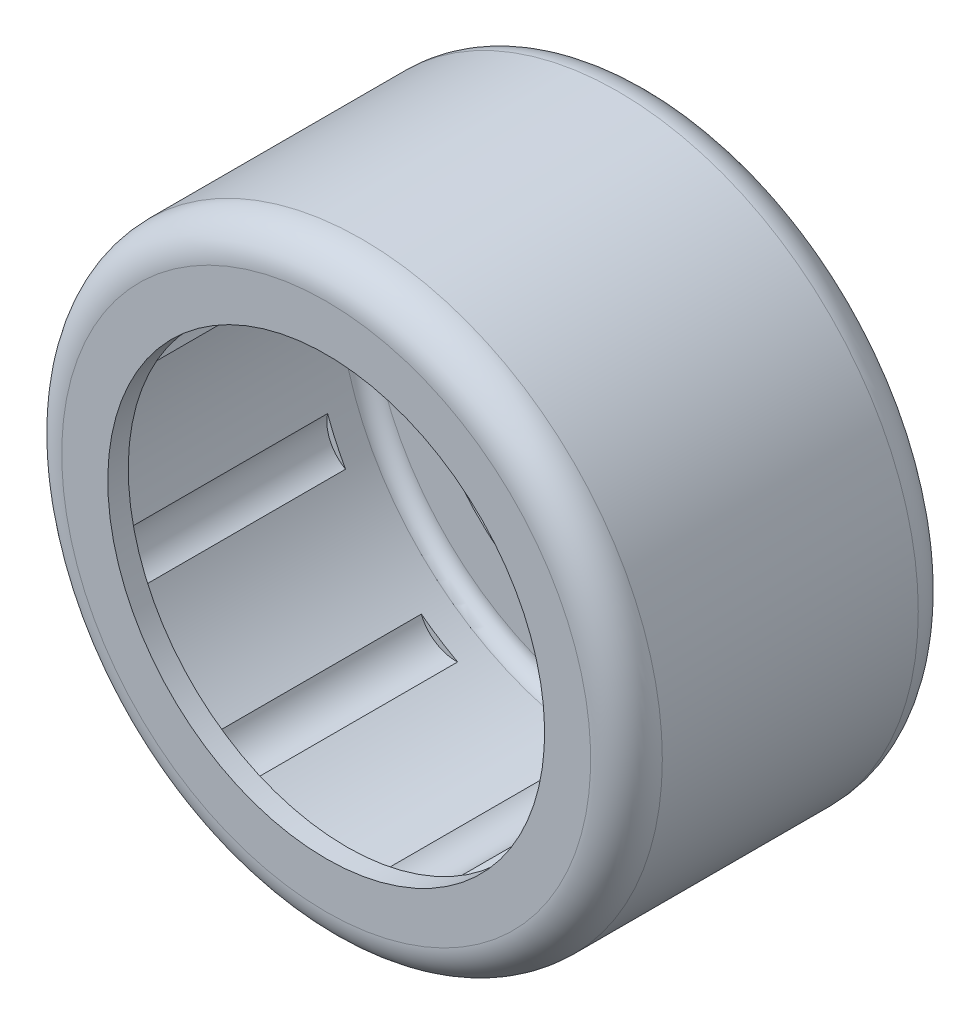
ISO-10303-21;
HEADER;
FILE_DESCRIPTION(('STEP AP214'),'2;1');
FILE_NAME('part.step','',(''),(''),'','','');
FILE_SCHEMA(('AUTOMOTIVE_DESIGN { 1 0 10303 214 1 1 1 1 }'));
ENDSEC;
DATA;
#1=APPLICATION_CONTEXT('core data for automotive mechanical design processes');
#2=APPLICATION_PROTOCOL_DEFINITION('international standard','automotive_design',2000,#1);
#3=PRODUCT_CONTEXT('',#1,'mechanical');
#4=PRODUCT('Part','Part','',(#3));
#5=PRODUCT_RELATED_PRODUCT_CATEGORY('part','',(#4));
#6=PRODUCT_DEFINITION_FORMATION('','',#4);
#7=PRODUCT_DEFINITION_CONTEXT('part definition',#1,'design');
#8=PRODUCT_DEFINITION('design','',#6,#7);
#9=PRODUCT_DEFINITION_SHAPE('','',#8);
#10=(LENGTH_UNIT() NAMED_UNIT(*) SI_UNIT(.MILLI.,.METRE.));
#11=(NAMED_UNIT(*) PLANE_ANGLE_UNIT() SI_UNIT($,.RADIAN.));
#12=(NAMED_UNIT(*) SI_UNIT($,.STERADIAN.) SOLID_ANGLE_UNIT());
#13=UNCERTAINTY_MEASURE_WITH_UNIT(LENGTH_MEASURE(1.E-05),#10,'distance_accuracy_value','');
#14=(GEOMETRIC_REPRESENTATION_CONTEXT(3) GLOBAL_UNCERTAINTY_ASSIGNED_CONTEXT((#13)) GLOBAL_UNIT_ASSIGNED_CONTEXT((#10,
#11,#12)) REPRESENTATION_CONTEXT('',''));
#15=CARTESIAN_POINT('',(0.,0.,0.));
#16=DIRECTION('',(0.,0.,1.));
#17=DIRECTION('',(1.,0.,0.));
#18=AXIS2_PLACEMENT_3D('',#15,#16,#17);
#19=CARTESIAN_POINT('',(0.,0.,11.625));
#20=DIRECTION('',(0.,0.,-1.));
#21=DIRECTION('',(0.,-1.,0.));
#22=AXIS2_PLACEMENT_3D('',#19,#20,#21);
#23=CYLINDRICAL_SURFACE('',#22,8.);
#24=CARTESIAN_POINT('',(0.,0.,0.750000000000015));
#25=DIRECTION('',(0.,0.,-1.));
#26=DIRECTION('',(-1.,0.,0.));
#27=AXIS2_PLACEMENT_3D('',#24,#25,#26);
#28=CIRCLE('',#27,8.);
#29=CARTESIAN_POINT('',(-8.,0.,0.750000000000015));
#30=VERTEX_POINT('',#29);
#31=EDGE_CURVE('E349',#30,#30,#28,.T.);
#32=ORIENTED_EDGE('',*,*,#31,.F.);
#33=EDGE_LOOP('',(#32));
#34=FACE_BOUND('',#33,.T.);
#35=CARTESIAN_POINT('',(0.,0.,0.));
#36=DIRECTION('',(0.,0.,-1.));
#37=DIRECTION('',(1.,0.,0.));
#38=AXIS2_PLACEMENT_3D('',#35,#36,#37);
#39=CIRCLE('',#38,8.);
#40=CARTESIAN_POINT('',(8.,0.,0.));
#41=VERTEX_POINT('',#40);
#42=EDGE_CURVE('E367',#41,#41,#39,.T.);
#43=ORIENTED_EDGE('',*,*,#42,.T.);
#44=EDGE_LOOP('',(#43));
#45=FACE_BOUND('',#44,.T.);
#46=ADVANCED_FACE('F17',(#34,#45),#23,.F.);
#47=CARTESIAN_POINT('',(0.,0.,11.625));
#48=DIRECTION('',(0.,0.,-1.));
#49=DIRECTION('',(0.,-1.,0.));
#50=AXIS2_PLACEMENT_3D('',#47,#48,#49);
#51=CYLINDRICAL_SURFACE('',#50,8.);
#52=CARTESIAN_POINT('',(0.,0.,12.));
#53=DIRECTION('',(0.,0.,-1.));
#54=DIRECTION('',(0.,-1.,0.));
#55=AXIS2_PLACEMENT_3D('',#52,#53,#54);
#56=CIRCLE('',#55,8.);
#57=CARTESIAN_POINT('',(0.,-8.,12.));
#58=VERTEX_POINT('',#57);
#59=EDGE_CURVE('E340',#58,#58,#56,.T.);
#60=ORIENTED_EDGE('',*,*,#59,.F.);
#61=EDGE_LOOP('',(#60));
#62=FACE_BOUND('',#61,.T.);
#63=CARTESIAN_POINT('',(0.,0.,11.25));
#64=DIRECTION('',(0.,0.,-1.));
#65=DIRECTION('',(0.,-1.,0.));
#66=AXIS2_PLACEMENT_3D('',#63,#64,#65);
#67=CIRCLE('',#66,8.);
#68=CARTESIAN_POINT('',(0.,-8.,11.25));
#69=VERTEX_POINT('',#68);
#70=EDGE_CURVE('E11',#69,#69,#67,.T.);
#71=ORIENTED_EDGE('',*,*,#70,.T.);
#72=EDGE_LOOP('',(#71));
#73=FACE_BOUND('',#72,.T.);
#74=ADVANCED_FACE('F563',(#62,#73),#51,.F.);
#75=CARTESIAN_POINT('',(0.,-9.125,11.25));
#76=DIRECTION('',(0.,0.,-1.));
#77=DIRECTION('',(0.,-1.,0.));
#78=AXIS2_PLACEMENT_3D('',#75,#76,#77);
#79=PLANE('',#78);
#80=ORIENTED_EDGE('',*,*,#70,.F.);
#81=EDGE_LOOP('',(#80));
#82=FACE_BOUND('',#81,.T.);
#83=CARTESIAN_POINT('',(0.,0.,11.25));
#84=DIRECTION('',(0.,0.,1.));
#85=DIRECTION('',(0.,1.,0.));
#86=AXIS2_PLACEMENT_3D('',#83,#84,#85);
#87=CIRCLE('',#86,9.6875);
#88=CARTESIAN_POINT('',(0.,9.6875,11.25));
#89=VERTEX_POINT('',#88);
#90=EDGE_CURVE('E27',#89,#89,#87,.T.);
#91=ORIENTED_EDGE('',*,*,#90,.F.);
#92=EDGE_LOOP('',(#91));
#93=FACE_BOUND('',#92,.T.);
#94=ADVANCED_FACE('F568',(#82,#93),#79,.T.);
#95=CARTESIAN_POINT('',(0.,0.,10.6875));
#96=DIRECTION('',(0.,0.,-1.));
#97=DIRECTION('',(1.,0.,0.));
#98=AXIS2_PLACEMENT_3D('',#95,#96,#97);
#99=TOROIDAL_SURFACE('',#98,9.6875,0.5625);
#100=ORIENTED_EDGE('',*,*,#90,.T.);
#101=EDGE_LOOP('',(#100));
#102=FACE_BOUND('',#101,.T.);
#103=CARTESIAN_POINT('',(0.,0.,10.6875));
#104=DIRECTION('',(0.,0.,-1.));
#105=DIRECTION('',(0.,1.,0.));
#106=AXIS2_PLACEMENT_3D('',#103,#104,#105);
#107=CIRCLE('',#106,10.25);
#108=CARTESIAN_POINT('',(0.,10.25,10.6875));
#109=VERTEX_POINT('',#108);
#110=EDGE_CURVE('E359',#109,#109,#107,.T.);
#111=ORIENTED_EDGE('',*,*,#110,.T.);
#112=EDGE_LOOP('',(#111));
#113=FACE_BOUND('',#112,.T.);
#114=ADVANCED_FACE('F612',(#102,#113),#99,.F.);
#115=CARTESIAN_POINT('',(0.,-9.125,0.750000000000015));
#116=DIRECTION('',(0.,0.,1.));
#117=DIRECTION('',(1.,0.,0.));
#118=AXIS2_PLACEMENT_3D('',#115,#116,#117);
#119=PLANE('',#118);
#120=ORIENTED_EDGE('',*,*,#31,.T.);
#121=EDGE_LOOP('',(#120));
#122=FACE_BOUND('',#121,.T.);
#123=CARTESIAN_POINT('',(0.,0.,0.750000000000015));
#124=DIRECTION('',(0.,0.,-1.));
#125=DIRECTION('',(0.,1.,0.));
#126=AXIS2_PLACEMENT_3D('',#123,#124,#125);
#127=CIRCLE('',#126,9.6875);
#128=CARTESIAN_POINT('',(0.,9.6875,0.750000000000015));
#129=VERTEX_POINT('',#128);
#130=EDGE_CURVE('E336',#129,#129,#127,.T.);
#131=ORIENTED_EDGE('',*,*,#130,.F.);
#132=EDGE_LOOP('',(#131));
#133=FACE_BOUND('',#132,.T.);
#134=ADVANCED_FACE('F664',(#122,#133),#119,.T.);
#135=CARTESIAN_POINT('',(0.,0.,10.1136351921262));
#136=DIRECTION('',(0.,0.,-1.));
#137=DIRECTION('',(0.,-1.,0.));
#138=AXIS2_PLACEMENT_3D('',#135,#136,#137);
#139=CYLINDRICAL_SURFACE('',#138,10.25);
#140=ORIENTED_EDGE('',*,*,#110,.F.);
#141=EDGE_LOOP('',(#140));
#142=FACE_BOUND('',#141,.T.);
#143=CARTESIAN_POINT('',(0.,0.,2.325));
#144=DIRECTION('',(0.,0.,1.));
#145=DIRECTION('',(0.,-1.,0.));
#146=AXIS2_PLACEMENT_3D('',#143,#144,#145);
#147=CIRCLE('',#146,10.25);
#148=CARTESIAN_POINT('',(-0.790316225389345,-10.2194863013699,2.325));
#149=VERTEX_POINT('',#148);
#150=CARTESIAN_POINT('',(0.790316225389429,-10.2194863013699,2.325));
#151=VERTEX_POINT('',#150);
#152=EDGE_CURVE('E253',#149,#151,#147,.T.);
#153=ORIENTED_EDGE('',*,*,#152,.T.);
#154=DIRECTION('',(0.,0.,1.));
#155=VECTOR('',#154,1.);
#156=CARTESIAN_POINT('',(0.790316225389429,-10.2194863013699,6.));
#157=LINE('',#156,#155);
#158=CARTESIAN_POINT('',(0.790316225389429,-10.2194863013699,9.675));
#159=VERTEX_POINT('',#158);
#160=EDGE_CURVE('E237',#151,#159,#157,.T.);
#161=ORIENTED_EDGE('',*,*,#160,.T.);
#162=CARTESIAN_POINT('',(0.,0.,9.675));
#163=DIRECTION('',(0.,0.,-1.));
#164=DIRECTION('',(0.,1.,0.));
#165=AXIS2_PLACEMENT_3D('',#162,#163,#164);
#166=CIRCLE('',#165,10.25);
#167=CARTESIAN_POINT('',(-0.790316225389345,-10.2194863013699,9.675));
#168=VERTEX_POINT('',#167);
#169=EDGE_CURVE('E264',#159,#168,#166,.T.);
#170=ORIENTED_EDGE('',*,*,#169,.T.);
#171=DIRECTION('',(0.,0.,-1.));
#172=VECTOR('',#171,1.);
#173=CARTESIAN_POINT('',(-0.790316225389345,-10.2194863013699,6.));
#174=LINE('',#173,#172);
#175=EDGE_CURVE('E249',#168,#149,#174,.T.);
#176=ORIENTED_EDGE('',*,*,#175,.T.);
#177=EDGE_LOOP('',(#153,#161,#170,#176));
#178=FACE_BOUND('',#177,.T.);
#179=CARTESIAN_POINT('',(0.,0.,2.325));
#180=DIRECTION('',(0.,0.,1.));
#181=DIRECTION('',(0.,-1.,0.));
#182=AXIS2_PLACEMENT_3D('',#179,#180,#181);
#183=CIRCLE('',#182,10.25);
#184=CARTESIAN_POINT('',(-6.18992774461147,-8.1699017446043,2.325));
#185=VERTEX_POINT('',#184);
#186=CARTESIAN_POINT('',(-4.86021511128622,-9.02445616489023,2.325));
#187=VERTEX_POINT('',#186);
#188=EDGE_CURVE('E417',#185,#187,#183,.T.);
#189=ORIENTED_EDGE('',*,*,#188,.T.);
#190=DIRECTION('',(0.,0.,1.));
#191=VECTOR('',#190,1.);
#192=CARTESIAN_POINT('',(-4.86021511128622,-9.02445616489023,6.));
#193=LINE('',#192,#191);
#194=CARTESIAN_POINT('',(-4.86021511128622,-9.02445616489023,9.675));
#195=VERTEX_POINT('',#194);
#196=EDGE_CURVE('E416',#187,#195,#193,.T.);
#197=ORIENTED_EDGE('',*,*,#196,.T.);
#198=CARTESIAN_POINT('',(0.,0.,9.675));
#199=DIRECTION('',(0.,0.,-1.));
#200=DIRECTION('',(0.,1.,0.));
#201=AXIS2_PLACEMENT_3D('',#198,#199,#200);
#202=CIRCLE('',#201,10.25);
#203=CARTESIAN_POINT('',(-6.18992774461147,-8.1699017446043,9.675));
#204=VERTEX_POINT('',#203);
#205=EDGE_CURVE('E442',#195,#204,#202,.T.);
#206=ORIENTED_EDGE('',*,*,#205,.T.);
#207=DIRECTION('',(0.,0.,-1.));
#208=VECTOR('',#207,1.);
#209=CARTESIAN_POINT('',(-6.18992774461147,-8.1699017446043,6.));
#210=LINE('',#209,#208);
#211=EDGE_CURVE('E426',#204,#185,#210,.T.);
#212=ORIENTED_EDGE('',*,*,#211,.T.);
#213=EDGE_LOOP('',(#189,#197,#206,#212));
#214=FACE_BOUND('',#213,.T.);
#215=CARTESIAN_POINT('',(0.,0.,2.325));
#216=DIRECTION('',(0.,0.,1.));
#217=DIRECTION('',(0.,-1.,0.));
#218=AXIS2_PLACEMENT_3D('',#215,#216,#217);
#219=CIRCLE('',#218,10.25);
#220=CARTESIAN_POINT('',(-9.62428094085893,-3.5264311096942,2.325));
#221=VERTEX_POINT('',#220);
#222=CARTESIAN_POINT('',(-8.96766249076746,-4.96422495981819,2.325));
#223=VERTEX_POINT('',#222);
#224=EDGE_CURVE('E329',#221,#223,#219,.T.);
#225=ORIENTED_EDGE('',*,*,#224,.T.);
#226=DIRECTION('',(0.,0.,1.));
#227=VECTOR('',#226,1.);
#228=CARTESIAN_POINT('',(-8.96766249076746,-4.96422495981819,6.));
#229=LINE('',#228,#227);
#230=CARTESIAN_POINT('',(-8.96766249076746,-4.96422495981819,9.675));
#231=VERTEX_POINT('',#230);
#232=EDGE_CURVE('E313',#223,#231,#229,.T.);
#233=ORIENTED_EDGE('',*,*,#232,.T.);
#234=CARTESIAN_POINT('',(0.,0.,9.675));
#235=DIRECTION('',(0.,0.,-1.));
#236=DIRECTION('',(0.,1.,0.));
#237=AXIS2_PLACEMENT_3D('',#234,#235,#236);
#238=CIRCLE('',#237,10.25);
#239=CARTESIAN_POINT('',(-9.62428094085893,-3.5264311096942,9.675));
#240=VERTEX_POINT('',#239);
#241=EDGE_CURVE('E375',#231,#240,#238,.T.);
#242=ORIENTED_EDGE('',*,*,#241,.T.);
#243=DIRECTION('',(0.,0.,-1.));
#244=VECTOR('',#243,1.);
#245=CARTESIAN_POINT('',(-9.62428094085893,-3.5264311096942,6.));
#246=LINE('',#245,#244);
#247=EDGE_CURVE('E316',#240,#221,#246,.T.);
#248=ORIENTED_EDGE('',*,*,#247,.T.);
#249=EDGE_LOOP('',(#225,#233,#242,#248));
#250=FACE_BOUND('',#249,.T.);
#251=CARTESIAN_POINT('',(0.,0.,2.325));
#252=DIRECTION('',(0.,0.,1.));
#253=DIRECTION('',(0.,-1.,0.));
#254=AXIS2_PLACEMENT_3D('',#251,#252,#253);
#255=CIRCLE('',#254,10.25);
#256=CARTESIAN_POINT('',(-10.0029929403033,2.23665648597226,2.325));
#257=VERTEX_POINT('',#256);
#258=CARTESIAN_POINT('',(-10.2279403919054,0.672112594458652,2.325));
#259=VERTEX_POINT('',#258);
#260=EDGE_CURVE('E297',#257,#259,#255,.T.);
#261=ORIENTED_EDGE('',*,*,#260,.T.);
#262=DIRECTION('',(0.,0.,1.));
#263=VECTOR('',#262,1.);
#264=CARTESIAN_POINT('',(-10.2279403919054,0.672112594458652,6.));
#265=LINE('',#264,#263);
#266=CARTESIAN_POINT('',(-10.2279403919054,0.672112594458652,9.675));
#267=VERTEX_POINT('',#266);
#268=EDGE_CURVE('E303',#259,#267,#265,.T.);
#269=ORIENTED_EDGE('',*,*,#268,.T.);
#270=CARTESIAN_POINT('',(0.,0.,9.675));
#271=DIRECTION('',(0.,0.,-1.));
#272=DIRECTION('',(0.,1.,0.));
#273=AXIS2_PLACEMENT_3D('',#270,#271,#272);
#274=CIRCLE('',#273,10.25);
#275=CARTESIAN_POINT('',(-10.0029929403033,2.23665648597226,9.675));
#276=VERTEX_POINT('',#275);
#277=EDGE_CURVE('E479',#267,#276,#274,.T.);
#278=ORIENTED_EDGE('',*,*,#277,.T.);
#279=DIRECTION('',(0.,0.,-1.));
#280=VECTOR('',#279,1.);
#281=CARTESIAN_POINT('',(-10.0029929403033,2.23665648597226,6.));
#282=LINE('',#281,#280);
#283=EDGE_CURVE('E305',#276,#257,#282,.T.);
#284=ORIENTED_EDGE('',*,*,#283,.T.);
#285=EDGE_LOOP('',(#261,#269,#278,#284));
#286=FACE_BOUND('',#285,.T.);
#287=CARTESIAN_POINT('',(0.,0.,2.325));
#288=DIRECTION('',(0.,0.,1.));
#289=DIRECTION('',(0.,-1.,0.));
#290=AXIS2_PLACEMENT_3D('',#287,#288,#289);
#291=CIRCLE('',#290,10.25);
#292=CARTESIAN_POINT('',(-7.20582535897205,7.28962145080214,2.325));
#293=VERTEX_POINT('',#292);
#294=CARTESIAN_POINT('',(-8.24091948578677,6.09505914891562,2.325));
#295=VERTEX_POINT('',#294);
#296=EDGE_CURVE('E341',#293,#295,#291,.T.);
#297=ORIENTED_EDGE('',*,*,#296,.T.);
#298=DIRECTION('',(0.,0.,1.));
#299=VECTOR('',#298,1.);
#300=CARTESIAN_POINT('',(-8.24091948578677,6.09505914891562,6.));
#301=LINE('',#300,#299);
#302=CARTESIAN_POINT('',(-8.24091948578677,6.09505914891562,9.675));
#303=VERTEX_POINT('',#302);
#304=EDGE_CURVE('E468',#295,#303,#301,.T.);
#305=ORIENTED_EDGE('',*,*,#304,.T.);
#306=CARTESIAN_POINT('',(0.,0.,9.675));
#307=DIRECTION('',(0.,0.,-1.));
#308=DIRECTION('',(0.,1.,0.));
#309=AXIS2_PLACEMENT_3D('',#306,#307,#308);
#310=CIRCLE('',#309,10.25);
#311=CARTESIAN_POINT('',(-7.20582535897205,7.28962145080214,9.675));
#312=VERTEX_POINT('',#311);
#313=EDGE_CURVE('E461',#303,#312,#310,.T.);
#314=ORIENTED_EDGE('',*,*,#313,.T.);
#315=DIRECTION('',(0.,0.,-1.));
#316=VECTOR('',#315,1.);
#317=CARTESIAN_POINT('',(-7.20582535897205,7.28962145080214,6.));
#318=LINE('',#317,#316);
#319=EDGE_CURVE('E476',#312,#293,#318,.T.);
#320=ORIENTED_EDGE('',*,*,#319,.T.);
#321=EDGE_LOOP('',(#297,#305,#314,#320));
#322=FACE_BOUND('',#321,.T.);
#323=CARTESIAN_POINT('',(0.,0.,2.325));
#324=DIRECTION('',(0.,0.,1.));
#325=DIRECTION('',(0.,-1.,0.));
#326=AXIS2_PLACEMENT_3D('',#323,#324,#325);
#327=CIRCLE('',#326,10.25);
#328=CARTESIAN_POINT('',(-2.12085914009622,10.0281831110062,2.325));
#329=VERTEX_POINT('',#328);
#330=CARTESIAN_POINT('',(-3.63746487048551,9.58286748922177,2.325));
#331=VERTEX_POINT('',#330);
#332=EDGE_CURVE('E453',#329,#331,#327,.T.);
#333=ORIENTED_EDGE('',*,*,#332,.T.);
#334=DIRECTION('',(0.,0.,1.));
#335=VECTOR('',#334,1.);
#336=CARTESIAN_POINT('',(-3.63746487048549,9.58286748922177,6.));
#337=LINE('',#336,#335);
#338=CARTESIAN_POINT('',(-3.63746487048551,9.58286748922177,9.675));
#339=VERTEX_POINT('',#338);
#340=EDGE_CURVE('E350',#331,#339,#337,.T.);
#341=ORIENTED_EDGE('',*,*,#340,.T.);
#342=CARTESIAN_POINT('',(0.,0.,9.675));
#343=DIRECTION('',(0.,0.,-1.));
#344=DIRECTION('',(0.,1.,0.));
#345=AXIS2_PLACEMENT_3D('',#342,#343,#344);
#346=CIRCLE('',#345,10.25);
#347=CARTESIAN_POINT('',(-2.12085914009622,10.0281831110062,9.675));
#348=VERTEX_POINT('',#347);
#349=EDGE_CURVE('E320',#339,#348,#346,.T.);
#350=ORIENTED_EDGE('',*,*,#349,.T.);
#351=DIRECTION('',(0.,0.,-1.));
#352=VECTOR('',#351,1.);
#353=CARTESIAN_POINT('',(-2.12085914009622,10.0281831110062,6.));
#354=LINE('',#353,#352);
#355=EDGE_CURVE('E353',#348,#329,#354,.T.);
#356=ORIENTED_EDGE('',*,*,#355,.T.);
#357=EDGE_LOOP('',(#333,#341,#350,#356));
#358=FACE_BOUND('',#357,.T.);
#359=CARTESIAN_POINT('',(0.,0.,2.325));
#360=DIRECTION('',(0.,0.,1.));
#361=DIRECTION('',(0.,-1.,0.));
#362=AXIS2_PLACEMENT_3D('',#359,#360,#361);
#363=CIRCLE('',#362,10.25);
#364=CARTESIAN_POINT('',(3.63746487048558,9.58286748922177,2.325));
#365=VERTEX_POINT('',#364);
#366=CARTESIAN_POINT('',(2.1208591400963,10.0281831110062,2.325));
#367=VERTEX_POINT('',#366);
#368=EDGE_CURVE('E287',#365,#367,#363,.T.);
#369=ORIENTED_EDGE('',*,*,#368,.T.);
#370=DIRECTION('',(0.,0.,1.));
#371=VECTOR('',#370,1.);
#372=CARTESIAN_POINT('',(2.1208591400963,10.0281831110062,6.));
#373=LINE('',#372,#371);
#374=CARTESIAN_POINT('',(2.1208591400963,10.0281831110062,9.675));
#375=VERTEX_POINT('',#374);
#376=EDGE_CURVE('E321',#367,#375,#373,.T.);
#377=ORIENTED_EDGE('',*,*,#376,.T.);
#378=CARTESIAN_POINT('',(0.,0.,9.675));
#379=DIRECTION('',(0.,0.,-1.));
#380=DIRECTION('',(0.,1.,0.));
#381=AXIS2_PLACEMENT_3D('',#378,#379,#380);
#382=CIRCLE('',#381,10.25);
#383=CARTESIAN_POINT('',(3.63746487048558,9.58286748922177,9.675));
#384=VERTEX_POINT('',#383);
#385=EDGE_CURVE('E402',#375,#384,#382,.T.);
#386=ORIENTED_EDGE('',*,*,#385,.T.);
#387=DIRECTION('',(0.,0.,-1.));
#388=VECTOR('',#387,1.);
#389=CARTESIAN_POINT('',(3.63746487048558,9.58286748922177,6.));
#390=LINE('',#389,#388);
#391=EDGE_CURVE('E317',#384,#365,#390,.T.);
#392=ORIENTED_EDGE('',*,*,#391,.T.);
#393=EDGE_LOOP('',(#369,#377,#386,#392));
#394=FACE_BOUND('',#393,.T.);
#395=CARTESIAN_POINT('',(0.,0.,2.325));
#396=DIRECTION('',(0.,0.,1.));
#397=DIRECTION('',(0.,-1.,0.));
#398=AXIS2_PLACEMENT_3D('',#395,#396,#397);
#399=CIRCLE('',#398,10.25);
#400=CARTESIAN_POINT('',(8.24091948578686,6.09505914891562,2.325));
#401=VERTEX_POINT('',#400);
#402=CARTESIAN_POINT('',(7.20582535897213,7.28962145080214,2.325));
#403=VERTEX_POINT('',#402);
#404=EDGE_CURVE('E273',#401,#403,#399,.T.);
#405=ORIENTED_EDGE('',*,*,#404,.T.);
#406=DIRECTION('',(0.,0.,1.));
#407=VECTOR('',#406,1.);
#408=CARTESIAN_POINT('',(7.20582535897213,7.28962145080214,6.));
#409=LINE('',#408,#407);
#410=CARTESIAN_POINT('',(7.20582535897213,7.28962145080214,9.675));
#411=VERTEX_POINT('',#410);
#412=EDGE_CURVE('E381',#403,#411,#409,.T.);
#413=ORIENTED_EDGE('',*,*,#412,.T.);
#414=CARTESIAN_POINT('',(0.,0.,9.675));
#415=DIRECTION('',(0.,0.,-1.));
#416=DIRECTION('',(0.,1.,0.));
#417=AXIS2_PLACEMENT_3D('',#414,#415,#416);
#418=CIRCLE('',#417,10.25);
#419=CARTESIAN_POINT('',(8.24091948578684,6.09505914891562,9.675));
#420=VERTEX_POINT('',#419);
#421=EDGE_CURVE('E274',#411,#420,#418,.T.);
#422=ORIENTED_EDGE('',*,*,#421,.T.);
#423=DIRECTION('',(0.,0.,-1.));
#424=VECTOR('',#423,1.);
#425=CARTESIAN_POINT('',(8.24091948578684,6.09505914891562,6.));
#426=LINE('',#425,#424);
#427=EDGE_CURVE('E391',#420,#401,#426,.T.);
#428=ORIENTED_EDGE('',*,*,#427,.T.);
#429=EDGE_LOOP('',(#405,#413,#422,#428));
#430=FACE_BOUND('',#429,.T.);
#431=CARTESIAN_POINT('',(0.,0.,2.325));
#432=DIRECTION('',(0.,0.,1.));
#433=DIRECTION('',(0.,-1.,0.));
#434=AXIS2_PLACEMENT_3D('',#431,#432,#433);
#435=CIRCLE('',#434,10.25);
#436=CARTESIAN_POINT('',(10.2279403919054,0.672112594458652,2.325));
#437=VERTEX_POINT('',#436);
#438=CARTESIAN_POINT('',(10.0029929403033,2.23665648597226,2.325));
#439=VERTEX_POINT('',#438);
#440=EDGE_CURVE('E418',#437,#439,#435,.T.);
#441=ORIENTED_EDGE('',*,*,#440,.T.);
#442=DIRECTION('',(0.,0.,1.));
#443=VECTOR('',#442,1.);
#444=CARTESIAN_POINT('',(10.0029929403033,2.23665648597226,6.));
#445=LINE('',#444,#443);
#446=CARTESIAN_POINT('',(10.0029929403033,2.23665648597226,9.675));
#447=VERTEX_POINT('',#446);
#448=EDGE_CURVE('E296',#439,#447,#445,.T.);
#449=ORIENTED_EDGE('',*,*,#448,.T.);
#450=CARTESIAN_POINT('',(0.,0.,9.675));
#451=DIRECTION('',(0.,0.,-1.));
#452=DIRECTION('',(0.,1.,0.));
#453=AXIS2_PLACEMENT_3D('',#450,#451,#452);
#454=CIRCLE('',#453,10.25);
#455=CARTESIAN_POINT('',(10.2279403919054,0.672112594458652,9.675));
#456=VERTEX_POINT('',#455);
#457=EDGE_CURVE('E446',#447,#456,#454,.T.);
#458=ORIENTED_EDGE('',*,*,#457,.T.);
#459=DIRECTION('',(0.,0.,-1.));
#460=VECTOR('',#459,1.);
#461=CARTESIAN_POINT('',(10.2279403919054,0.672112594458652,6.));
#462=LINE('',#461,#460);
#463=EDGE_CURVE('E293',#456,#437,#462,.T.);
#464=ORIENTED_EDGE('',*,*,#463,.T.);
#465=EDGE_LOOP('',(#441,#449,#458,#464));
#466=FACE_BOUND('',#465,.T.);
#467=CARTESIAN_POINT('',(0.,0.,2.325));
#468=DIRECTION('',(0.,0.,1.));
#469=DIRECTION('',(0.,-1.,0.));
#470=AXIS2_PLACEMENT_3D('',#467,#468,#469);
#471=CIRCLE('',#470,10.25);
#472=CARTESIAN_POINT('',(8.96766249076755,-4.96422495981819,2.325));
#473=VERTEX_POINT('',#472);
#474=CARTESIAN_POINT('',(9.62428094085901,-3.5264311096942,2.325));
#475=VERTEX_POINT('',#474);
#476=EDGE_CURVE('E363',#473,#475,#471,.T.);
#477=ORIENTED_EDGE('',*,*,#476,.T.);
#478=DIRECTION('',(0.,0.,1.));
#479=VECTOR('',#478,1.);
#480=CARTESIAN_POINT('',(9.62428094085901,-3.5264311096942,6.));
#481=LINE('',#480,#479);
#482=CARTESIAN_POINT('',(9.62428094085901,-3.5264311096942,9.675));
#483=VERTEX_POINT('',#482);
#484=EDGE_CURVE('E275',#475,#483,#481,.T.);
#485=ORIENTED_EDGE('',*,*,#484,.T.);
#486=CARTESIAN_POINT('',(0.,0.,9.675));
#487=DIRECTION('',(0.,0.,-1.));
#488=DIRECTION('',(0.,1.,0.));
#489=AXIS2_PLACEMENT_3D('',#486,#487,#488);
#490=CIRCLE('',#489,10.25);
#491=CARTESIAN_POINT('',(8.96766249076754,-4.96422495981819,9.675));
#492=VERTEX_POINT('',#491);
#493=EDGE_CURVE('E281',#483,#492,#490,.T.);
#494=ORIENTED_EDGE('',*,*,#493,.T.);
#495=DIRECTION('',(0.,0.,-1.));
#496=VECTOR('',#495,1.);
#497=CARTESIAN_POINT('',(8.96766249076755,-4.96422495981819,6.));
#498=LINE('',#497,#496);
#499=EDGE_CURVE('E279',#492,#473,#498,.T.);
#500=ORIENTED_EDGE('',*,*,#499,.T.);
#501=EDGE_LOOP('',(#477,#485,#494,#500));
#502=FACE_BOUND('',#501,.T.);
#503=CARTESIAN_POINT('',(0.,0.,2.325));
#504=DIRECTION('',(0.,0.,1.));
#505=DIRECTION('',(0.,-1.,0.));
#506=AXIS2_PLACEMENT_3D('',#503,#504,#505);
#507=CIRCLE('',#506,10.25);
#508=CARTESIAN_POINT('',(4.8602151112863,-9.02445616489023,2.325));
#509=VERTEX_POINT('',#508);
#510=CARTESIAN_POINT('',(6.18992774461155,-8.1699017446043,2.325));
#511=VERTEX_POINT('',#510);
#512=EDGE_CURVE('E311',#509,#511,#507,.T.);
#513=ORIENTED_EDGE('',*,*,#512,.T.);
#514=DIRECTION('',(0.,0.,1.));
#515=VECTOR('',#514,1.);
#516=CARTESIAN_POINT('',(6.18992774461155,-8.1699017446043,6.));
#517=LINE('',#516,#515);
#518=CARTESIAN_POINT('',(6.18992774461155,-8.1699017446043,9.675));
#519=VERTEX_POINT('',#518);
#520=EDGE_CURVE('E324',#511,#519,#517,.T.);
#521=ORIENTED_EDGE('',*,*,#520,.T.);
#522=CARTESIAN_POINT('',(0.,0.,9.675));
#523=DIRECTION('',(0.,0.,-1.));
#524=DIRECTION('',(0.,-1.,0.));
#525=AXIS2_PLACEMENT_3D('',#522,#523,#524);
#526=CIRCLE('',#525,10.25);
#527=CARTESIAN_POINT('',(4.8602151112863,-9.02445616489023,9.675));
#528=VERTEX_POINT('',#527);
#529=EDGE_CURVE('E312',#519,#528,#526,.T.);
#530=ORIENTED_EDGE('',*,*,#529,.T.);
#531=DIRECTION('',(0.,0.,-1.));
#532=VECTOR('',#531,1.);
#533=CARTESIAN_POINT('',(4.8602151112863,-9.02445616489023,6.));
#534=LINE('',#533,#532);
#535=EDGE_CURVE('E286',#528,#509,#534,.T.);
#536=ORIENTED_EDGE('',*,*,#535,.T.);
#537=EDGE_LOOP('',(#513,#521,#530,#536));
#538=FACE_BOUND('',#537,.T.);
#539=CARTESIAN_POINT('',(0.,0.,1.3125));
#540=DIRECTION('',(0.,0.,1.));
#541=DIRECTION('',(0.,1.,0.));
#542=AXIS2_PLACEMENT_3D('',#539,#540,#541);
#543=CIRCLE('',#542,10.25);
#544=CARTESIAN_POINT('',(0.,10.25,1.3125));
#545=VERTEX_POINT('',#544);
#546=EDGE_CURVE('E339',#545,#545,#543,.T.);
#547=ORIENTED_EDGE('',*,*,#546,.F.);
#548=EDGE_LOOP('',(#547));
#549=FACE_BOUND('',#548,.T.);
#550=ADVANCED_FACE('F256',(#142,#178,#214,#250,#286,#322,#358,#394,#430,#466,#502,#538,#549),
#139,.F.);
#551=CARTESIAN_POINT('',(0.,0.,1.3125));
#552=DIRECTION('',(0.,0.,-1.));
#553=DIRECTION('',(1.,0.,0.));
#554=AXIS2_PLACEMENT_3D('',#551,#552,#553);
#555=TOROIDAL_SURFACE('',#554,9.6875,0.5625);
#556=ORIENTED_EDGE('',*,*,#546,.T.);
#557=EDGE_LOOP('',(#556));
#558=FACE_BOUND('',#557,.T.);
#559=ORIENTED_EDGE('',*,*,#130,.T.);
#560=EDGE_LOOP('',(#559));
#561=FACE_BOUND('',#560,.T.);
#562=ADVANCED_FACE('F663',(#558,#561),#555,.F.);
#563=CARTESIAN_POINT('',(0.,-9.5,12.));
#564=DIRECTION('',(0.,0.,1.));
#565=DIRECTION('',(1.,0.,0.));
#566=AXIS2_PLACEMENT_3D('',#563,#564,#565);
#567=PLANE('',#566);
#568=ORIENTED_EDGE('',*,*,#59,.T.);
#569=EDGE_LOOP('',(#568));
#570=FACE_BOUND('',#569,.T.);
#571=CARTESIAN_POINT('',(0.,0.,12.));
#572=DIRECTION('',(0.,0.,-1.));
#573=DIRECTION('',(0.,1.,0.));
#574=AXIS2_PLACEMENT_3D('',#571,#572,#573);
#575=CIRCLE('',#574,9.6875);
#576=CARTESIAN_POINT('',(0.,9.6875,12.));
#577=VERTEX_POINT('',#576);
#578=EDGE_CURVE('E370',#577,#577,#575,.T.);
#579=ORIENTED_EDGE('',*,*,#578,.F.);
#580=EDGE_LOOP('',(#579));
#581=FACE_BOUND('',#580,.T.);
#582=ADVANCED_FACE('F910',(#570,#581),#567,.T.);
#583=CARTESIAN_POINT('',(0.,0.,10.6875));
#584=DIRECTION('',(0.,0.,-1.));
#585=DIRECTION('',(1.,0.,0.));
#586=AXIS2_PLACEMENT_3D('',#583,#584,#585);
#587=TOROIDAL_SURFACE('',#586,9.6875,1.3125);
#588=ORIENTED_EDGE('',*,*,#578,.T.);
#589=EDGE_LOOP('',(#588));
#590=FACE_BOUND('',#589,.T.);
#591=CARTESIAN_POINT('',(0.,0.,10.6875));
#592=DIRECTION('',(0.,0.,1.));
#593=DIRECTION('',(0.,1.,0.));
#594=AXIS2_PLACEMENT_3D('',#591,#592,#593);
#595=CIRCLE('',#594,11.);
#596=CARTESIAN_POINT('',(0.,11.,10.6875));
#597=VERTEX_POINT('',#596);
#598=EDGE_CURVE('E366',#597,#597,#595,.T.);
#599=ORIENTED_EDGE('',*,*,#598,.T.);
#600=EDGE_LOOP('',(#599));
#601=FACE_BOUND('',#600,.T.);
#602=ADVANCED_FACE('F579',(#590,#601),#587,.T.);
#603=CARTESIAN_POINT('',(0.,-9.5,0.));
#604=DIRECTION('',(0.,0.,-1.));
#605=DIRECTION('',(0.,-1.,0.));
#606=AXIS2_PLACEMENT_3D('',#603,#604,#605);
#607=PLANE('',#606);
#608=ORIENTED_EDGE('',*,*,#42,.F.);
#609=EDGE_LOOP('',(#608));
#610=FACE_BOUND('',#609,.T.);
#611=CARTESIAN_POINT('',(0.,0.,0.));
#612=DIRECTION('',(0.,0.,1.));
#613=DIRECTION('',(0.,1.,0.));
#614=AXIS2_PLACEMENT_3D('',#611,#612,#613);
#615=CIRCLE('',#614,9.6875);
#616=CARTESIAN_POINT('',(0.,9.6875,0.));
#617=VERTEX_POINT('',#616);
#618=EDGE_CURVE('E325',#617,#617,#615,.T.);
#619=ORIENTED_EDGE('',*,*,#618,.F.);
#620=EDGE_LOOP('',(#619));
#621=FACE_BOUND('',#620,.T.);
#622=ADVANCED_FACE('F575',(#610,#621),#607,.T.);
#623=CARTESIAN_POINT('',(0.,0.,6.));
#624=DIRECTION('',(0.,0.,-1.));
#625=DIRECTION('',(0.,-1.,0.));
#626=AXIS2_PLACEMENT_3D('',#623,#624,#625);
#627=CYLINDRICAL_SURFACE('',#626,11.);
#628=ORIENTED_EDGE('',*,*,#598,.F.);
#629=EDGE_LOOP('',(#628));
#630=FACE_BOUND('',#629,.T.);
#631=CARTESIAN_POINT('',(0.,0.,1.3125));
#632=DIRECTION('',(0.,0.,-1.));
#633=DIRECTION('',(0.,1.,0.));
#634=AXIS2_PLACEMENT_3D('',#631,#632,#633);
#635=CIRCLE('',#634,11.);
#636=CARTESIAN_POINT('',(0.,11.,1.3125));
#637=VERTEX_POINT('',#636);
#638=EDGE_CURVE('E328',#637,#637,#635,.T.);
#639=ORIENTED_EDGE('',*,*,#638,.F.);
#640=EDGE_LOOP('',(#639));
#641=FACE_BOUND('',#640,.T.);
#642=ADVANCED_FACE('F578',(#630,#641),#627,.T.);
#643=CARTESIAN_POINT('',(0.,0.,1.3125));
#644=DIRECTION('',(0.,0.,-1.));
#645=DIRECTION('',(1.,0.,0.));
#646=AXIS2_PLACEMENT_3D('',#643,#644,#645);
#647=TOROIDAL_SURFACE('',#646,9.6875,1.3125);
#648=ORIENTED_EDGE('',*,*,#638,.T.);
#649=EDGE_LOOP('',(#648));
#650=FACE_BOUND('',#649,.T.);
#651=ORIENTED_EDGE('',*,*,#618,.T.);
#652=EDGE_LOOP('',(#651));
#653=FACE_BOUND('',#652,.T.);
#654=ADVANCED_FACE('F583',(#650,#653),#647,.T.);
#655=CARTESIAN_POINT('',(0.,-9.125,6.));
#656=DIRECTION('',(0.,0.,1.));
#657=DIRECTION('',(0.,-1.,0.));
#658=AXIS2_PLACEMENT_3D('',#655,#656,#657);
#659=CYLINDRICAL_SURFACE('',#658,1.35);
#660=ORIENTED_EDGE('',*,*,#160,.F.);
#661=CARTESIAN_POINT('',(0.,-9.125,2.325));
#662=DIRECTION('',(0.,0.,1.));
#663=DIRECTION('',(0.,-1.,0.));
#664=AXIS2_PLACEMENT_3D('',#661,#662,#663);
#665=CIRCLE('',#664,1.35);
#666=EDGE_CURVE('E240',#149,#151,#665,.T.);
#667=ORIENTED_EDGE('',*,*,#666,.F.);
#668=ORIENTED_EDGE('',*,*,#175,.F.);
#669=CARTESIAN_POINT('',(0.,-9.125,9.675));
#670=DIRECTION('',(0.,0.,1.));
#671=DIRECTION('',(0.,1.,0.));
#672=AXIS2_PLACEMENT_3D('',#669,#670,#671);
#673=CIRCLE('',#672,1.35);
#674=EDGE_CURVE('E243',#168,#159,#673,.T.);
#675=ORIENTED_EDGE('',*,*,#674,.T.);
#676=EDGE_LOOP('',(#660,#667,#668,#675));
#677=FACE_BOUND('',#676,.T.);
#678=ADVANCED_FACE('F239',(#677),#659,.F.);
#679=CARTESIAN_POINT('',(5.2982800110649,-8.24428462174554,2.325));
#680=DIRECTION('',(0.,0.,-1.));
#681=DIRECTION('',(0.,-1.,0.));
#682=AXIS2_PLACEMENT_3D('',#679,#680,#681);
#683=PLANE('',#682);
#684=ORIENTED_EDGE('',*,*,#152,.F.);
#685=ORIENTED_EDGE('',*,*,#666,.T.);
#686=EDGE_LOOP('',(#684,#685));
#687=FACE_BOUND('',#686,.T.);
#688=ADVANCED_FACE('F252',(#687),#683,.F.);
#689=CARTESIAN_POINT('',(5.2982800110649,-8.24428462174554,9.675));
#690=DIRECTION('',(0.,0.,1.));
#691=DIRECTION('',(0.,-1.,0.));
#692=AXIS2_PLACEMENT_3D('',#689,#690,#691);
#693=PLANE('',#692);
#694=ORIENTED_EDGE('',*,*,#169,.F.);
#695=ORIENTED_EDGE('',*,*,#674,.F.);
#696=EDGE_LOOP('',(#694,#695));
#697=FACE_BOUND('',#696,.T.);
#698=ADVANCED_FACE('F642',(#697),#693,.F.);
#699=CARTESIAN_POINT('',(-4.93334745928228,-7.67643848708455,6.));
#700=DIRECTION('',(0.,0.,1.));
#701=DIRECTION('',(-0.540640817455597,-0.841253532831181,0.));
#702=AXIS2_PLACEMENT_3D('',#699,#700,#701);
#703=CYLINDRICAL_SURFACE('',#702,1.35);
#704=ORIENTED_EDGE('',*,*,#196,.F.);
#705=CARTESIAN_POINT('',(-4.93334745928228,-7.67643848708455,2.325));
#706=DIRECTION('',(0.,0.,1.));
#707=DIRECTION('',(0.,-1.,0.));
#708=AXIS2_PLACEMENT_3D('',#705,#706,#707);
#709=CIRCLE('',#708,1.35);
#710=EDGE_CURVE('E413',#185,#187,#709,.T.);
#711=ORIENTED_EDGE('',*,*,#710,.F.);
#712=ORIENTED_EDGE('',*,*,#211,.F.);
#713=CARTESIAN_POINT('',(-4.93334745928228,-7.67643848708455,9.675));
#714=DIRECTION('',(0.,0.,1.));
#715=DIRECTION('',(0.,1.,0.));
#716=AXIS2_PLACEMENT_3D('',#713,#714,#715);
#717=CIRCLE('',#716,1.35);
#718=EDGE_CURVE('E505',#204,#195,#717,.T.);
#719=ORIENTED_EDGE('',*,*,#718,.T.);
#720=EDGE_LOOP('',(#704,#711,#712,#719));
#721=FACE_BOUND('',#720,.T.);
#722=ADVANCED_FACE('F844',(#721),#703,.F.);
#723=CARTESIAN_POINT('',(5.2982800110649,-8.24428462174554,2.325));
#724=DIRECTION('',(0.,0.,-1.));
#725=DIRECTION('',(0.,-1.,0.));
#726=AXIS2_PLACEMENT_3D('',#723,#724,#725);
#727=PLANE('',#726);
#728=ORIENTED_EDGE('',*,*,#188,.F.);
#729=ORIENTED_EDGE('',*,*,#710,.T.);
#730=EDGE_LOOP('',(#728,#729));
#731=FACE_BOUND('',#730,.T.);
#732=ADVANCED_FACE('F659',(#731),#727,.F.);
#733=CARTESIAN_POINT('',(5.2982800110649,-8.24428462174554,9.675));
#734=DIRECTION('',(0.,0.,1.));
#735=DIRECTION('',(0.,-1.,0.));
#736=AXIS2_PLACEMENT_3D('',#733,#734,#735);
#737=PLANE('',#736);
#738=ORIENTED_EDGE('',*,*,#205,.F.);
#739=ORIENTED_EDGE('',*,*,#718,.F.);
#740=EDGE_LOOP('',(#738,#739));
#741=FACE_BOUND('',#740,.T.);
#742=ADVANCED_FACE('F656',(#741),#737,.F.);
#743=CARTESIAN_POINT('',(-8.30039195760994,-3.79066199364219,6.));
#744=DIRECTION('',(0.,0.,1.));
#745=DIRECTION('',(-0.909631995354519,-0.415415013001886,0.));
#746=AXIS2_PLACEMENT_3D('',#743,#744,#745);
#747=CYLINDRICAL_SURFACE('',#746,1.35);
#748=ORIENTED_EDGE('',*,*,#232,.F.);
#749=CARTESIAN_POINT('',(-8.30039195760994,-3.79066199364219,2.325));
#750=DIRECTION('',(0.,0.,1.));
#751=DIRECTION('',(0.,-1.,0.));
#752=AXIS2_PLACEMENT_3D('',#749,#750,#751);
#753=CIRCLE('',#752,1.35);
#754=EDGE_CURVE('E268',#221,#223,#753,.T.);
#755=ORIENTED_EDGE('',*,*,#754,.F.);
#756=ORIENTED_EDGE('',*,*,#247,.F.);
#757=CARTESIAN_POINT('',(-8.30039195760994,-3.79066199364219,9.675));
#758=DIRECTION('',(0.,0.,1.));
#759=DIRECTION('',(0.,1.,0.));
#760=AXIS2_PLACEMENT_3D('',#757,#758,#759);
#761=CIRCLE('',#760,1.35);
#762=EDGE_CURVE('E333',#240,#231,#761,.T.);
#763=ORIENTED_EDGE('',*,*,#762,.T.);
#764=EDGE_LOOP('',(#748,#755,#756,#763));
#765=FACE_BOUND('',#764,.T.);
#766=ADVANCED_FACE('F649',(#765),#747,.F.);
#767=CARTESIAN_POINT('',(5.2982800110649,-8.24428462174554,2.325));
#768=DIRECTION('',(0.,0.,-1.));
#769=DIRECTION('',(0.,-1.,0.));
#770=AXIS2_PLACEMENT_3D('',#767,#768,#769);
#771=PLANE('',#770);
#772=ORIENTED_EDGE('',*,*,#224,.F.);
#773=ORIENTED_EDGE('',*,*,#754,.T.);
#774=EDGE_LOOP('',(#772,#773));
#775=FACE_BOUND('',#774,.T.);
#776=ADVANCED_FACE('F629',(#775),#771,.F.);
#777=CARTESIAN_POINT('',(5.2982800110649,-8.24428462174554,9.675));
#778=DIRECTION('',(0.,0.,1.));
#779=DIRECTION('',(0.,-1.,0.));
#780=AXIS2_PLACEMENT_3D('',#777,#778,#779);
#781=PLANE('',#780);
#782=ORIENTED_EDGE('',*,*,#241,.F.);
#783=ORIENTED_EDGE('',*,*,#762,.F.);
#784=EDGE_LOOP('',(#782,#783));
#785=FACE_BOUND('',#784,.T.);
#786=ADVANCED_FACE('F626',(#785),#781,.F.);
#787=CARTESIAN_POINT('',(-9.03212065716348,1.29862289924376,6.));
#788=DIRECTION('',(0.,0.,1.));
#789=DIRECTION('',(-0.989821441880933,0.142314838273285,0.));
#790=AXIS2_PLACEMENT_3D('',#787,#788,#789);
#791=CYLINDRICAL_SURFACE('',#790,1.35);
#792=ORIENTED_EDGE('',*,*,#268,.F.);
#793=CARTESIAN_POINT('',(-9.03212065716348,1.29862289924376,2.325));
#794=DIRECTION('',(0.,0.,1.));
#795=DIRECTION('',(0.,-1.,0.));
#796=AXIS2_PLACEMENT_3D('',#793,#794,#795);
#797=CIRCLE('',#796,1.35);
#798=EDGE_CURVE('E301',#257,#259,#797,.T.);
#799=ORIENTED_EDGE('',*,*,#798,.F.);
#800=ORIENTED_EDGE('',*,*,#283,.F.);
#801=CARTESIAN_POINT('',(-9.03212065716348,1.29862289924376,9.675));
#802=DIRECTION('',(0.,0.,1.));
#803=DIRECTION('',(0.,1.,0.));
#804=AXIS2_PLACEMENT_3D('',#801,#802,#803);
#805=CIRCLE('',#804,1.35);
#806=EDGE_CURVE('E302',#276,#267,#805,.T.);
#807=ORIENTED_EDGE('',*,*,#806,.T.);
#808=EDGE_LOOP('',(#792,#799,#800,#807));
#809=FACE_BOUND('',#808,.T.);
#810=ADVANCED_FACE('F596',(#809),#791,.F.);
#811=CARTESIAN_POINT('',(5.2982800110649,-8.24428462174554,2.325));
#812=DIRECTION('',(0.,0.,-1.));
#813=DIRECTION('',(0.,-1.,0.));
#814=AXIS2_PLACEMENT_3D('',#811,#812,#813);
#815=PLANE('',#814);
#816=ORIENTED_EDGE('',*,*,#260,.F.);
#817=ORIENTED_EDGE('',*,*,#798,.T.);
#818=EDGE_LOOP('',(#816,#817));
#819=FACE_BOUND('',#818,.T.);
#820=ADVANCED_FACE('F631',(#819),#815,.F.);
#821=CARTESIAN_POINT('',(5.2982800110649,-8.24428462174554,9.675));
#822=DIRECTION('',(0.,0.,1.));
#823=DIRECTION('',(0.,-1.,0.));
#824=AXIS2_PLACEMENT_3D('',#821,#822,#823);
#825=PLANE('',#824);
#826=ORIENTED_EDGE('',*,*,#277,.F.);
#827=ORIENTED_EDGE('',*,*,#806,.F.);
#828=EDGE_LOOP('',(#826,#827));
#829=FACE_BOUND('',#828,.T.);
#830=ADVANCED_FACE('F634',(#829),#825,.F.);
#831=CARTESIAN_POINT('',(-6.89621486598258,5.97560419725074,6.));
#832=DIRECTION('',(0.,0.,1.));
#833=DIRECTION('',(-0.755749574354258,0.654860733945285,0.));
#834=AXIS2_PLACEMENT_3D('',#831,#832,#833);
#835=CYLINDRICAL_SURFACE('',#834,1.35);
#836=ORIENTED_EDGE('',*,*,#304,.F.);
#837=CARTESIAN_POINT('',(-6.89621486598258,5.97560419725074,2.325));
#838=DIRECTION('',(0.,0.,1.));
#839=DIRECTION('',(0.,-1.,0.));
#840=AXIS2_PLACEMENT_3D('',#837,#838,#839);
#841=CIRCLE('',#840,1.35);
#842=EDGE_CURVE('E345',#293,#295,#841,.T.);
#843=ORIENTED_EDGE('',*,*,#842,.F.);
#844=ORIENTED_EDGE('',*,*,#319,.F.);
#845=CARTESIAN_POINT('',(-6.89621486598258,5.97560419725074,9.675));
#846=DIRECTION('',(0.,0.,1.));
#847=DIRECTION('',(0.,1.,0.));
#848=AXIS2_PLACEMENT_3D('',#845,#846,#847);
#849=CIRCLE('',#848,1.35);
#850=EDGE_CURVE('E346',#312,#303,#849,.T.);
#851=ORIENTED_EDGE('',*,*,#850,.T.);
#852=EDGE_LOOP('',(#836,#843,#844,#851));
#853=FACE_BOUND('',#852,.T.);
#854=ADVANCED_FACE('F643',(#853),#835,.F.);
#855=CARTESIAN_POINT('',(5.2982800110649,-8.24428462174554,2.325));
#856=DIRECTION('',(0.,0.,-1.));
#857=DIRECTION('',(0.,-1.,0.));
#858=AXIS2_PLACEMENT_3D('',#855,#856,#857);
#859=PLANE('',#858);
#860=ORIENTED_EDGE('',*,*,#296,.F.);
#861=ORIENTED_EDGE('',*,*,#842,.T.);
#862=EDGE_LOOP('',(#860,#861));
#863=FACE_BOUND('',#862,.T.);
#864=ADVANCED_FACE('F638',(#863),#859,.F.);
#865=CARTESIAN_POINT('',(5.2982800110649,-8.24428462174554,9.675));
#866=DIRECTION('',(0.,0.,1.));
#867=DIRECTION('',(0.,-1.,0.));
#868=AXIS2_PLACEMENT_3D('',#865,#866,#867);
#869=PLANE('',#868);
#870=ORIENTED_EDGE('',*,*,#313,.F.);
#871=ORIENTED_EDGE('',*,*,#850,.F.);
#872=EDGE_LOOP('',(#870,#871));
#873=FACE_BOUND('',#872,.T.);
#874=ADVANCED_FACE('F606',(#873),#869,.F.);
#875=CARTESIAN_POINT('',(-2.570809581178,8.75537338423227,6.));
#876=DIRECTION('',(0.,0.,1.));
#877=DIRECTION('',(-0.28173255684143,0.959492973614497,0.));
#878=AXIS2_PLACEMENT_3D('',#875,#876,#877);
#879=CYLINDRICAL_SURFACE('',#878,1.35);
#880=ORIENTED_EDGE('',*,*,#340,.F.);
#881=CARTESIAN_POINT('',(-2.570809581178,8.75537338423227,2.325));
#882=DIRECTION('',(0.,0.,1.));
#883=DIRECTION('',(0.,-1.,0.));
#884=AXIS2_PLACEMENT_3D('',#881,#882,#883);
#885=CIRCLE('',#884,1.35);
#886=EDGE_CURVE('E20',#329,#331,#885,.T.);
#887=ORIENTED_EDGE('',*,*,#886,.F.);
#888=ORIENTED_EDGE('',*,*,#355,.F.);
#889=CARTESIAN_POINT('',(-2.570809581178,8.75537338423227,9.675));
#890=DIRECTION('',(0.,0.,1.));
#891=DIRECTION('',(0.,1.,0.));
#892=AXIS2_PLACEMENT_3D('',#889,#890,#891);
#893=CIRCLE('',#892,1.35);
#894=EDGE_CURVE('E457',#348,#339,#893,.T.);
#895=ORIENTED_EDGE('',*,*,#894,.T.);
#896=EDGE_LOOP('',(#880,#887,#888,#895));
#897=FACE_BOUND('',#896,.T.);
#898=ADVANCED_FACE('F602',(#897),#879,.F.);
#899=CARTESIAN_POINT('',(5.2982800110649,-8.24428462174554,2.325));
#900=DIRECTION('',(0.,0.,-1.));
#901=DIRECTION('',(0.,-1.,0.));
#902=AXIS2_PLACEMENT_3D('',#899,#900,#901);
#903=PLANE('',#902);
#904=ORIENTED_EDGE('',*,*,#332,.F.);
#905=ORIENTED_EDGE('',*,*,#886,.T.);
#906=EDGE_LOOP('',(#904,#905));
#907=FACE_BOUND('',#906,.T.);
#908=ADVANCED_FACE('F605',(#907),#903,.F.);
#909=CARTESIAN_POINT('',(5.2982800110649,-8.24428462174554,9.675));
#910=DIRECTION('',(0.,0.,1.));
#911=DIRECTION('',(0.,-1.,0.));
#912=AXIS2_PLACEMENT_3D('',#909,#910,#911);
#913=PLANE('',#912);
#914=ORIENTED_EDGE('',*,*,#349,.F.);
#915=ORIENTED_EDGE('',*,*,#894,.F.);
#916=EDGE_LOOP('',(#914,#915));
#917=FACE_BOUND('',#916,.T.);
#918=ADVANCED_FACE('F558',(#917),#913,.F.);
#919=CARTESIAN_POINT('',(2.57080958117809,8.75537338423227,6.));
#920=DIRECTION('',(0.,0.,1.));
#921=DIRECTION('',(0.281732556841429,0.959492973614498,0.));
#922=AXIS2_PLACEMENT_3D('',#919,#920,#921);
#923=CYLINDRICAL_SURFACE('',#922,1.35);
#924=ORIENTED_EDGE('',*,*,#376,.F.);
#925=CARTESIAN_POINT('',(2.57080958117809,8.75537338423227,2.325));
#926=DIRECTION('',(0.,0.,1.));
#927=DIRECTION('',(0.,-1.,0.));
#928=AXIS2_PLACEMENT_3D('',#925,#926,#927);
#929=CIRCLE('',#928,1.35);
#930=EDGE_CURVE('E291',#365,#367,#929,.T.);
#931=ORIENTED_EDGE('',*,*,#930,.F.);
#932=ORIENTED_EDGE('',*,*,#391,.F.);
#933=CARTESIAN_POINT('',(2.57080958117809,8.75537338423227,9.675));
#934=DIRECTION('',(0.,0.,1.));
#935=DIRECTION('',(0.,1.,0.));
#936=AXIS2_PLACEMENT_3D('',#933,#934,#935);
#937=CIRCLE('',#936,1.35);
#938=EDGE_CURVE('E292',#384,#375,#937,.T.);
#939=ORIENTED_EDGE('',*,*,#938,.T.);
#940=EDGE_LOOP('',(#924,#931,#932,#939));
#941=FACE_BOUND('',#940,.T.);
#942=ADVANCED_FACE('F542',(#941),#923,.F.);
#943=CARTESIAN_POINT('',(5.2982800110649,-8.24428462174554,2.325));
#944=DIRECTION('',(0.,0.,-1.));
#945=DIRECTION('',(0.,-1.,0.));
#946=AXIS2_PLACEMENT_3D('',#943,#944,#945);
#947=PLANE('',#946);
#948=ORIENTED_EDGE('',*,*,#368,.F.);
#949=ORIENTED_EDGE('',*,*,#930,.T.);
#950=EDGE_LOOP('',(#948,#949));
#951=FACE_BOUND('',#950,.T.);
#952=ADVANCED_FACE('F549',(#951),#947,.F.);
#953=CARTESIAN_POINT('',(5.2982800110649,-8.24428462174554,9.675));
#954=DIRECTION('',(0.,0.,1.));
#955=DIRECTION('',(0.,-1.,0.));
#956=AXIS2_PLACEMENT_3D('',#953,#954,#955);
#957=PLANE('',#956);
#958=ORIENTED_EDGE('',*,*,#385,.F.);
#959=ORIENTED_EDGE('',*,*,#938,.F.);
#960=EDGE_LOOP('',(#958,#959));
#961=FACE_BOUND('',#960,.T.);
#962=ADVANCED_FACE('F545',(#961),#957,.F.);
#963=CARTESIAN_POINT('',(6.89621486598266,5.97560419725074,6.));
#964=DIRECTION('',(0.,0.,1.));
#965=DIRECTION('',(0.755749574354258,0.654860733945285,0.));
#966=AXIS2_PLACEMENT_3D('',#963,#964,#965);
#967=CYLINDRICAL_SURFACE('',#966,1.35);
#968=ORIENTED_EDGE('',*,*,#412,.F.);
#969=CARTESIAN_POINT('',(6.89621486598266,5.97560419725074,2.325));
#970=DIRECTION('',(0.,0.,1.));
#971=DIRECTION('',(0.,-1.,0.));
#972=AXIS2_PLACEMENT_3D('',#969,#970,#971);
#973=CIRCLE('',#972,1.35);
#974=EDGE_CURVE('E378',#401,#403,#973,.T.);
#975=ORIENTED_EDGE('',*,*,#974,.F.);
#976=ORIENTED_EDGE('',*,*,#427,.F.);
#977=CARTESIAN_POINT('',(6.89621486598266,5.97560419725074,9.675));
#978=DIRECTION('',(0.,0.,1.));
#979=DIRECTION('',(0.,1.,0.));
#980=AXIS2_PLACEMENT_3D('',#977,#978,#979);
#981=CIRCLE('',#980,1.35);
#982=EDGE_CURVE('E270',#420,#411,#981,.T.);
#983=ORIENTED_EDGE('',*,*,#982,.T.);
#984=EDGE_LOOP('',(#968,#975,#976,#983));
#985=FACE_BOUND('',#984,.T.);
#986=ADVANCED_FACE('F399',(#985),#967,.F.);
#987=CARTESIAN_POINT('',(5.2982800110649,-8.24428462174554,2.325));
#988=DIRECTION('',(0.,0.,-1.));
#989=DIRECTION('',(0.,-1.,0.));
#990=AXIS2_PLACEMENT_3D('',#987,#988,#989);
#991=PLANE('',#990);
#992=ORIENTED_EDGE('',*,*,#404,.F.);
#993=ORIENTED_EDGE('',*,*,#974,.T.);
#994=EDGE_LOOP('',(#992,#993));
#995=FACE_BOUND('',#994,.T.);
#996=ADVANCED_FACE('F622',(#995),#991,.F.);
#997=CARTESIAN_POINT('',(5.2982800110649,-8.24428462174554,9.675));
#998=DIRECTION('',(0.,0.,1.));
#999=DIRECTION('',(0.,-1.,0.));
#1000=AXIS2_PLACEMENT_3D('',#997,#998,#999);
#1001=PLANE('',#1000);
#1002=ORIENTED_EDGE('',*,*,#421,.F.);
#1003=ORIENTED_EDGE('',*,*,#982,.F.);
#1004=EDGE_LOOP('',(#1002,#1003));
#1005=FACE_BOUND('',#1004,.T.);
#1006=ADVANCED_FACE('F397',(#1005),#1001,.F.);
#1007=CARTESIAN_POINT('',(9.03212065716356,1.29862289924376,6.));
#1008=DIRECTION('',(0.,0.,1.));
#1009=DIRECTION('',(0.989821441880933,0.142314838273285,0.));
#1010=AXIS2_PLACEMENT_3D('',#1007,#1008,#1009);
#1011=CYLINDRICAL_SURFACE('',#1010,1.35);
#1012=ORIENTED_EDGE('',*,*,#448,.F.);
#1013=CARTESIAN_POINT('',(9.03212065716356,1.29862289924376,2.325));
#1014=DIRECTION('',(0.,0.,1.));
#1015=DIRECTION('',(0.,-1.,0.));
#1016=AXIS2_PLACEMENT_3D('',#1013,#1014,#1015);
#1017=CIRCLE('',#1016,1.35);
#1018=EDGE_CURVE('E422',#437,#439,#1017,.T.);
#1019=ORIENTED_EDGE('',*,*,#1018,.F.);
#1020=ORIENTED_EDGE('',*,*,#463,.F.);
#1021=CARTESIAN_POINT('',(9.03212065716356,1.29862289924376,9.675));
#1022=DIRECTION('',(0.,0.,1.));
#1023=DIRECTION('',(0.,1.,0.));
#1024=AXIS2_PLACEMENT_3D('',#1021,#1022,#1023);
#1025=CIRCLE('',#1024,1.35);
#1026=EDGE_CURVE('E423',#456,#447,#1025,.T.);
#1027=ORIENTED_EDGE('',*,*,#1026,.T.);
#1028=EDGE_LOOP('',(#1012,#1019,#1020,#1027));
#1029=FACE_BOUND('',#1028,.T.);
#1030=ADVANCED_FACE('F670',(#1029),#1011,.F.);
#1031=CARTESIAN_POINT('',(5.2982800110649,-8.24428462174554,2.325));
#1032=DIRECTION('',(0.,0.,-1.));
#1033=DIRECTION('',(0.,-1.,0.));
#1034=AXIS2_PLACEMENT_3D('',#1031,#1032,#1033);
#1035=PLANE('',#1034);
#1036=ORIENTED_EDGE('',*,*,#440,.F.);
#1037=ORIENTED_EDGE('',*,*,#1018,.T.);
#1038=EDGE_LOOP('',(#1036,#1037));
#1039=FACE_BOUND('',#1038,.T.);
#1040=ADVANCED_FACE('F673',(#1039),#1035,.F.);
#1041=CARTESIAN_POINT('',(5.2982800110649,-8.24428462174554,9.675));
#1042=DIRECTION('',(0.,0.,1.));
#1043=DIRECTION('',(0.,-1.,0.));
#1044=AXIS2_PLACEMENT_3D('',#1041,#1042,#1043);
#1045=PLANE('',#1044);
#1046=ORIENTED_EDGE('',*,*,#457,.F.);
#1047=ORIENTED_EDGE('',*,*,#1026,.F.);
#1048=EDGE_LOOP('',(#1046,#1047));
#1049=FACE_BOUND('',#1048,.T.);
#1050=ADVANCED_FACE('F668',(#1049),#1045,.F.);
#1051=CARTESIAN_POINT('',(8.30039195761004,-3.79066199364219,6.));
#1052=DIRECTION('',(0.,0.,1.));
#1053=DIRECTION('',(0.909631995354519,-0.415415013001886,0.));
#1054=AXIS2_PLACEMENT_3D('',#1051,#1052,#1053);
#1055=CYLINDRICAL_SURFACE('',#1054,1.35);
#1056=ORIENTED_EDGE('',*,*,#484,.F.);
#1057=CARTESIAN_POINT('',(8.30039195761004,-3.79066199364219,2.325));
#1058=DIRECTION('',(0.,0.,1.));
#1059=DIRECTION('',(0.,-1.,0.));
#1060=AXIS2_PLACEMENT_3D('',#1057,#1058,#1059);
#1061=CIRCLE('',#1060,1.35);
#1062=EDGE_CURVE('E280',#473,#475,#1061,.T.);
#1063=ORIENTED_EDGE('',*,*,#1062,.F.);
#1064=ORIENTED_EDGE('',*,*,#499,.F.);
#1065=CARTESIAN_POINT('',(8.30039195761004,-3.79066199364219,9.675));
#1066=DIRECTION('',(0.,0.,1.));
#1067=DIRECTION('',(0.,1.,0.));
#1068=AXIS2_PLACEMENT_3D('',#1065,#1066,#1067);
#1069=CIRCLE('',#1068,1.35);
#1070=EDGE_CURVE('E285',#492,#483,#1069,.T.);
#1071=ORIENTED_EDGE('',*,*,#1070,.T.);
#1072=EDGE_LOOP('',(#1056,#1063,#1064,#1071));
#1073=FACE_BOUND('',#1072,.T.);
#1074=ADVANCED_FACE('F654',(#1073),#1055,.F.);
#1075=CARTESIAN_POINT('',(5.2982800110649,-8.24428462174554,2.325));
#1076=DIRECTION('',(0.,0.,-1.));
#1077=DIRECTION('',(0.,-1.,0.));
#1078=AXIS2_PLACEMENT_3D('',#1075,#1076,#1077);
#1079=PLANE('',#1078);
#1080=ORIENTED_EDGE('',*,*,#476,.F.);
#1081=ORIENTED_EDGE('',*,*,#1062,.T.);
#1082=EDGE_LOOP('',(#1080,#1081));
#1083=FACE_BOUND('',#1082,.T.);
#1084=ADVANCED_FACE('F651',(#1083),#1079,.F.);
#1085=CARTESIAN_POINT('',(5.2982800110649,-8.24428462174554,9.675));
#1086=DIRECTION('',(0.,0.,1.));
#1087=DIRECTION('',(0.,-1.,0.));
#1088=AXIS2_PLACEMENT_3D('',#1085,#1086,#1087);
#1089=PLANE('',#1088);
#1090=ORIENTED_EDGE('',*,*,#493,.F.);
#1091=ORIENTED_EDGE('',*,*,#1070,.F.);
#1092=EDGE_LOOP('',(#1090,#1091));
#1093=FACE_BOUND('',#1092,.T.);
#1094=ADVANCED_FACE('F616',(#1093),#1089,.F.);
#1095=CARTESIAN_POINT('',(4.93334745928237,-7.67643848708455,6.));
#1096=DIRECTION('',(0.,0.,1.));
#1097=DIRECTION('',(0.540640817455597,-0.841253532831181,0.));
#1098=AXIS2_PLACEMENT_3D('',#1095,#1096,#1097);
#1099=CYLINDRICAL_SURFACE('',#1098,1.35);
#1100=ORIENTED_EDGE('',*,*,#520,.F.);
#1101=CARTESIAN_POINT('',(4.93334745928237,-7.67643848708455,2.325));
#1102=DIRECTION('',(0.,0.,1.));
#1103=DIRECTION('',(0.540640817455598,-0.841253532831181,0.));
#1104=AXIS2_PLACEMENT_3D('',#1101,#1102,#1103);
#1105=CIRCLE('',#1104,1.35);
#1106=EDGE_CURVE('E472',#509,#511,#1105,.T.);
#1107=ORIENTED_EDGE('',*,*,#1106,.F.);
#1108=ORIENTED_EDGE('',*,*,#535,.F.);
#1109=CARTESIAN_POINT('',(4.93334745928237,-7.67643848708455,9.675));
#1110=DIRECTION('',(0.,0.,1.));
#1111=DIRECTION('',(0.540640817455598,-0.841253532831181,0.));
#1112=AXIS2_PLACEMENT_3D('',#1109,#1110,#1111);
#1113=CIRCLE('',#1112,1.35);
#1114=EDGE_CURVE('E307',#528,#519,#1113,.T.);
#1115=ORIENTED_EDGE('',*,*,#1114,.T.);
#1116=EDGE_LOOP('',(#1100,#1107,#1108,#1115));
#1117=FACE_BOUND('',#1116,.T.);
#1118=ADVANCED_FACE('F614',(#1117),#1099,.F.);
#1119=CARTESIAN_POINT('',(5.2982800110649,-8.24428462174554,2.325));
#1120=DIRECTION('',(0.,0.,-1.));
#1121=DIRECTION('',(0.,-1.,0.));
#1122=AXIS2_PLACEMENT_3D('',#1119,#1120,#1121);
#1123=PLANE('',#1122);
#1124=ORIENTED_EDGE('',*,*,#512,.F.);
#1125=ORIENTED_EDGE('',*,*,#1106,.T.);
#1126=EDGE_LOOP('',(#1124,#1125));
#1127=FACE_BOUND('',#1126,.T.);
#1128=ADVANCED_FACE('F600',(#1127),#1123,.F.);
#1129=CARTESIAN_POINT('',(5.2982800110649,-8.24428462174554,9.675));
#1130=DIRECTION('',(0.,0.,1.));
#1131=DIRECTION('',(0.,-1.,0.));
#1132=AXIS2_PLACEMENT_3D('',#1129,#1130,#1131);
#1133=PLANE('',#1132);
#1134=ORIENTED_EDGE('',*,*,#529,.F.);
#1135=ORIENTED_EDGE('',*,*,#1114,.F.);
#1136=EDGE_LOOP('',(#1134,#1135));
#1137=FACE_BOUND('',#1136,.T.);
#1138=ADVANCED_FACE('F597',(#1137),#1133,.F.);
#1139=CLOSED_SHELL('',(#46,#74,#94,#114,#134,#550,#562,#582,#602,#622,#642,#654,#678,#688,#698,
#722,#732,#742,#766,#776,#786,#810,#820,#830,#854,#864,#874,#898,#908,#918,#942,#952,#962,#986,
#996,#1006,#1030,#1040,#1050,#1074,#1084,#1094,#1118,#1128,#1138));
#1140=MANIFOLD_SOLID_BREP('B1',#1139);
#1141=ADVANCED_BREP_SHAPE_REPRESENTATION('',(#18,#1140),#14);
#1142=SHAPE_DEFINITION_REPRESENTATION(#9,#1141);
ENDSEC;
END-ISO-10303-21;
